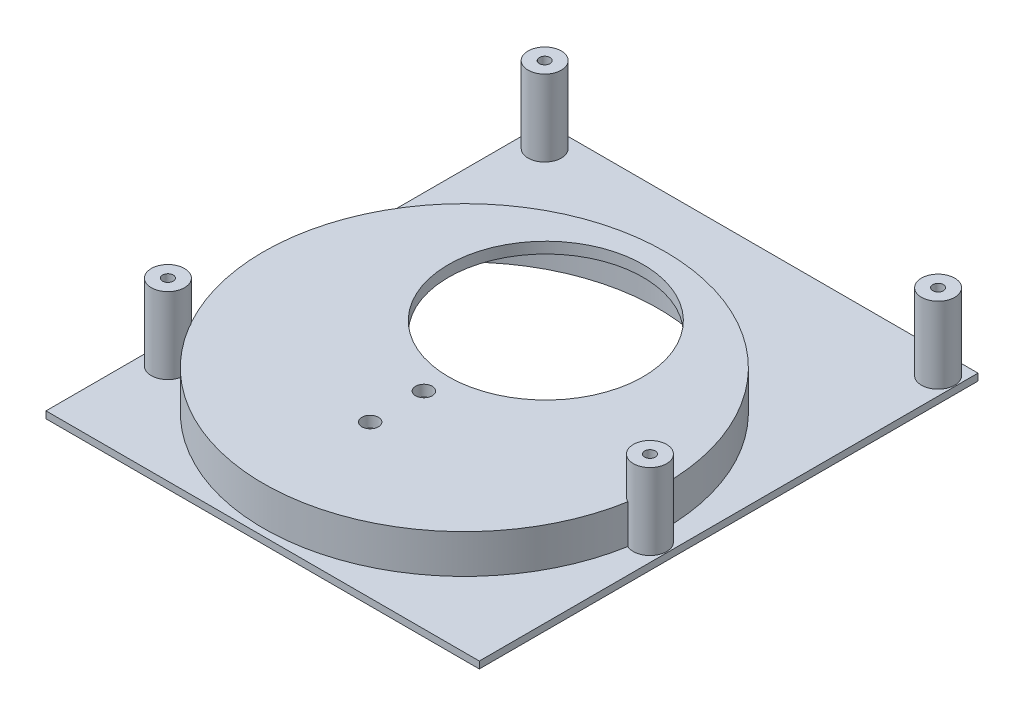
ISO-10303-21;
HEADER;
FILE_DESCRIPTION(('STEP AP214'),'2;1');
FILE_NAME('part.step','',(''),(''),'','','');
FILE_SCHEMA(('AUTOMOTIVE_DESIGN { 1 0 10303 214 1 1 1 1 }'));
ENDSEC;
DATA;
#1=APPLICATION_CONTEXT('core data for automotive mechanical design processes');
#2=APPLICATION_PROTOCOL_DEFINITION('international standard','automotive_design',2000,#1);
#3=PRODUCT_CONTEXT('',#1,'mechanical');
#4=PRODUCT('Part','Part','',(#3));
#5=PRODUCT_RELATED_PRODUCT_CATEGORY('part','',(#4));
#6=PRODUCT_DEFINITION_FORMATION('','',#4);
#7=PRODUCT_DEFINITION_CONTEXT('part definition',#1,'design');
#8=PRODUCT_DEFINITION('design','',#6,#7);
#9=PRODUCT_DEFINITION_SHAPE('','',#8);
#10=(LENGTH_UNIT() NAMED_UNIT(*) SI_UNIT(.MILLI.,.METRE.));
#11=(NAMED_UNIT(*) PLANE_ANGLE_UNIT() SI_UNIT($,.RADIAN.));
#12=(NAMED_UNIT(*) SI_UNIT($,.STERADIAN.) SOLID_ANGLE_UNIT());
#13=UNCERTAINTY_MEASURE_WITH_UNIT(LENGTH_MEASURE(1.E-05),#10,'distance_accuracy_value','');
#14=(GEOMETRIC_REPRESENTATION_CONTEXT(3) GLOBAL_UNCERTAINTY_ASSIGNED_CONTEXT((#13)) GLOBAL_UNIT_ASSIGNED_CONTEXT((#10,
#11,#12)) REPRESENTATION_CONTEXT('',''));
#15=CARTESIAN_POINT('',(0.,0.,0.));
#16=DIRECTION('',(0.,0.,1.));
#17=DIRECTION('',(1.,0.,0.));
#18=AXIS2_PLACEMENT_3D('',#15,#16,#17);
#19=CARTESIAN_POINT('',(-33.1283043886596,0.,-27.0683428392961));
#20=DIRECTION('',(0.,1.,0.));
#21=DIRECTION('',(0.,0.,1.));
#22=AXIS2_PLACEMENT_3D('',#19,#20,#21);
#23=CYLINDRICAL_SURFACE('',#22,44.45);
#24=CARTESIAN_POINT('',(-33.1283043886596,0.,-27.0683428392961));
#25=DIRECTION('',(0.,1.,0.));
#26=DIRECTION('',(0.,0.,1.));
#27=AXIS2_PLACEMENT_3D('',#24,#25,#26);
#28=CIRCLE('',#27,44.45);
#29=CARTESIAN_POINT('',(-33.1283043886596,0.,17.3816571607039));
#30=VERTEX_POINT('',#29);
#31=EDGE_CURVE('E172',#30,#30,#28,.T.);
#32=ORIENTED_EDGE('',*,*,#31,.F.);
#33=EDGE_LOOP('',(#32));
#34=FACE_BOUND('',#33,.T.);
#35=DIRECTION('',(0.,-1.,0.));
#36=VECTOR('',#35,1.);
#37=CARTESIAN_POINT('',(11.2917148238964,4.7625,-25.4360459434592));
#38=LINE('',#37,#36);
#39=CARTESIAN_POINT('',(11.2917148238964,7.9375,-25.4360459434592));
#40=VERTEX_POINT('',#39);
#41=CARTESIAN_POINT('',(11.2917148238964,1.5875,-25.4360459434592));
#42=VERTEX_POINT('',#41);
#43=EDGE_CURVE('E362',#40,#42,#38,.T.);
#44=ORIENTED_EDGE('',*,*,#43,.F.);
#45=CARTESIAN_POINT('',(-33.1283043886596,7.9375,-27.0683428392961));
#46=DIRECTION('',(0.,1.,0.));
#47=DIRECTION('',(0.,0.,1.));
#48=AXIS2_PLACEMENT_3D('',#45,#46,#47);
#49=CIRCLE('',#48,44.45);
#50=CARTESIAN_POINT('',(10.8098863535356,7.9375,-20.3424306853593));
#51=VERTEX_POINT('',#50);
#52=EDGE_CURVE('E380',#40,#51,#49,.T.);
#53=ORIENTED_EDGE('',*,*,#52,.T.);
#54=DIRECTION('',(0.,-1.,0.));
#55=VECTOR('',#54,1.);
#56=CARTESIAN_POINT('',(10.8098863535356,4.7625,-20.3424306853593));
#57=LINE('',#56,#55);
#58=CARTESIAN_POINT('',(10.8098863535356,1.5875,-20.3424306853593));
#59=VERTEX_POINT('',#58);
#60=EDGE_CURVE('E51',#59,#51,#57,.F.);
#61=ORIENTED_EDGE('',*,*,#60,.F.);
#62=CARTESIAN_POINT('',(-33.1283043886596,1.5875,-27.0683428392961));
#63=DIRECTION('',(0.,1.,0.));
#64=DIRECTION('',(0.,0.,1.));
#65=AXIS2_PLACEMENT_3D('',#62,#63,#64);
#66=CIRCLE('',#65,44.45);
#67=EDGE_CURVE('E55',#42,#59,#66,.F.);
#68=ORIENTED_EDGE('',*,*,#67,.F.);
#69=EDGE_LOOP('',(#44,#53,#61,#68));
#70=FACE_BOUND('',#69,.T.);
#71=ADVANCED_FACE('F36',(#34,#70),#23,.F.);
#72=CARTESIAN_POINT('',(-33.1283043886596,143.231213755503,-27.0683428392961));
#73=DIRECTION('',(0.,-1.,0.));
#74=DIRECTION('',(0.,0.,-1.));
#75=AXIS2_PLACEMENT_3D('',#72,#73,#74);
#76=CYLINDRICAL_SURFACE('',#75,46.0375);
#77=DIRECTION('',(0.,-1.,0.));
#78=VECTOR('',#77,1.);
#79=CARTESIAN_POINT('',(12.2285377446258,6.0325,-19.1811203911694));
#80=LINE('',#79,#78);
#81=CARTESIAN_POINT('',(12.2285377446257,10.4775,-19.1811203911693));
#82=VERTEX_POINT('',#81);
#83=CARTESIAN_POINT('',(12.2285377446257,1.5875,-19.1811203911694));
#84=VERTEX_POINT('',#83);
#85=EDGE_CURVE('E130',#82,#84,#80,.T.);
#86=ORIENTED_EDGE('',*,*,#85,.F.);
#87=CARTESIAN_POINT('',(-33.1283043886596,10.4775,-27.0683428392961));
#88=DIRECTION('',(0.,1.,0.));
#89=DIRECTION('',(0.,0.,1.));
#90=AXIS2_PLACEMENT_3D('',#87,#88,#89);
#91=CIRCLE('',#90,46.0375);
#92=CARTESIAN_POINT('',(-72.7118942561608,10.4775,-3.56109248006755));
#93=VERTEX_POINT('',#92);
#94=EDGE_CURVE('E153',#93,#82,#91,.T.);
#95=ORIENTED_EDGE('',*,*,#94,.F.);
#96=DIRECTION('',(0.,-1.,0.));
#97=VECTOR('',#96,1.);
#98=CARTESIAN_POINT('',(-72.7118942561609,5.23874999999999,-3.56109248006767));
#99=LINE('',#98,#97);
#100=CARTESIAN_POINT('',(-72.7118942561609,1.5875,-3.56109248006768));
#101=VERTEX_POINT('',#100);
#102=EDGE_CURVE('E211',#93,#101,#99,.T.);
#103=ORIENTED_EDGE('',*,*,#102,.T.);
#104=CARTESIAN_POINT('',(-33.1283043886596,1.58749999999999,-27.0683428392961));
#105=DIRECTION('',(0.,-1.,0.));
#106=DIRECTION('',(0.,0.,-1.));
#107=AXIS2_PLACEMENT_3D('',#104,#105,#106);
#108=CIRCLE('',#107,46.0375);
#109=EDGE_CURVE('E155',#101,#84,#108,.F.);
#110=ORIENTED_EDGE('',*,*,#109,.T.);
#111=EDGE_LOOP('',(#86,#95,#103,#110));
#112=FACE_BOUND('',#111,.T.);
#113=ADVANCED_FACE('F236',(#112),#76,.T.);
#114=DIRECTION('',(0.,-1.,0.));
#115=VECTOR('',#114,1.);
#116=CARTESIAN_POINT('',(12.9029616228515,6.0325,-26.3107442466989));
#117=LINE('',#116,#115);
#118=CARTESIAN_POINT('',(12.9029616228515,1.5875,-26.3107442466989));
#119=VERTEX_POINT('',#118);
#120=CARTESIAN_POINT('',(12.9029616228515,10.4775,-26.310744246699));
#121=VERTEX_POINT('',#120);
#122=EDGE_CURVE('E127',#119,#121,#117,.F.);
#123=ORIENTED_EDGE('',*,*,#122,.F.);
#124=CARTESIAN_POINT('',(-73.4066339678629,1.5875,-4.77243351585576));
#125=VERTEX_POINT('',#124);
#126=EDGE_CURVE('E142',#119,#125,#108,.F.);
#127=ORIENTED_EDGE('',*,*,#126,.T.);
#128=DIRECTION('',(0.,-1.,0.));
#129=VECTOR('',#128,1.);
#130=CARTESIAN_POINT('',(-73.4066339678629,5.23874999999999,-4.77243351585575));
#131=LINE('',#130,#129);
#132=CARTESIAN_POINT('',(-73.406633967863,10.4775,-4.77243351585587));
#133=VERTEX_POINT('',#132);
#134=EDGE_CURVE('E209',#125,#133,#131,.F.);
#135=ORIENTED_EDGE('',*,*,#134,.T.);
#136=EDGE_CURVE('E144',#121,#133,#91,.T.);
#137=ORIENTED_EDGE('',*,*,#136,.F.);
#138=EDGE_LOOP('',(#123,#127,#135,#137));
#139=FACE_BOUND('',#138,.T.);
#140=ADVANCED_FACE('F140',(#139),#76,.T.);
#141=CARTESIAN_POINT('',(0.,1.5875,0.));
#142=DIRECTION('',(0.,-1.,0.));
#143=DIRECTION('',(0.,0.,-1.));
#144=AXIS2_PLACEMENT_3D('',#141,#142,#143);
#145=PLANE('',#144);
#146=CARTESIAN_POINT('',(13.8616956113405,1.5875,-88.6633428392961));
#147=DIRECTION('',(0.,-1.,0.));
#148=DIRECTION('',(0.,0.,-1.));
#149=AXIS2_PLACEMENT_3D('',#146,#147,#148);
#150=CIRCLE('',#149,3.81);
#151=CARTESIAN_POINT('',(13.8616956113405,1.5875,-92.4733428392961));
#152=VERTEX_POINT('',#151);
#153=EDGE_CURVE('E12',#152,#152,#150,.F.);
#154=ORIENTED_EDGE('',*,*,#153,.F.);
#155=EDGE_LOOP('',(#154));
#156=FACE_BOUND('',#155,.T.);
#157=CARTESIAN_POINT('',(-76.3083043886595,1.5875,-88.6633428392961));
#158=DIRECTION('',(0.,-1.,0.));
#159=DIRECTION('',(0.,0.,-1.));
#160=AXIS2_PLACEMENT_3D('',#157,#158,#159);
#161=CIRCLE('',#160,3.81);
#162=CARTESIAN_POINT('',(-76.3083043886595,1.5875,-92.4733428392961));
#163=VERTEX_POINT('',#162);
#164=EDGE_CURVE('E44',#163,#163,#161,.F.);
#165=ORIENTED_EDGE('',*,*,#164,.F.);
#166=EDGE_LOOP('',(#165));
#167=FACE_BOUND('',#166,.T.);
#168=CARTESIAN_POINT('',(13.8616956113404,1.5875,-22.6233428392961));
#169=DIRECTION('',(0.,1.,0.));
#170=DIRECTION('',(0.,0.,1.));
#171=AXIS2_PLACEMENT_3D('',#168,#169,#170);
#172=CIRCLE('',#171,3.81);
#173=EDGE_CURVE('E124',#84,#119,#172,.T.);
#174=ORIENTED_EDGE('',*,*,#173,.F.);
#175=ORIENTED_EDGE('',*,*,#109,.F.);
#176=CARTESIAN_POINT('',(-76.3083043886596,1.5875,-2.30334283929615));
#177=DIRECTION('',(0.,-1.,0.));
#178=DIRECTION('',(0.,0.,-1.));
#179=AXIS2_PLACEMENT_3D('',#176,#177,#178);
#180=CIRCLE('',#179,3.81);
#181=EDGE_CURVE('E151',#125,#101,#180,.F.);
#182=ORIENTED_EDGE('',*,*,#181,.F.);
#183=ORIENTED_EDGE('',*,*,#126,.F.);
#184=EDGE_LOOP('',(#174,#175,#182,#183));
#185=FACE_BOUND('',#184,.T.);
#186=DIRECTION('',(-1.,0.,0.));
#187=VECTOR('',#186,1.);
#188=CARTESIAN_POINT('',(-81.3883043886595,1.5875,-93.7433428392961));
#189=LINE('',#188,#187);
#190=CARTESIAN_POINT('',(17.9256956113405,1.5875,-93.7433428392961));
#191=VERTEX_POINT('',#190);
#192=CARTESIAN_POINT('',(-81.3883043886595,1.5875,-93.7433428392961));
#193=VERTEX_POINT('',#192);
#194=EDGE_CURVE('E176',#191,#193,#189,.T.);
#195=ORIENTED_EDGE('',*,*,#194,.T.);
#196=DIRECTION('',(0.,0.,1.));
#197=VECTOR('',#196,1.);
#198=CARTESIAN_POINT('',(-81.3883043886595,1.5875,-93.7433428392961));
#199=LINE('',#198,#197);
#200=CARTESIAN_POINT('',(-81.3883043886595,1.5875,20.5566571607039));
#201=VERTEX_POINT('',#200);
#202=EDGE_CURVE('E179',#193,#201,#199,.T.);
#203=ORIENTED_EDGE('',*,*,#202,.T.);
#204=DIRECTION('',(1.,0.,0.));
#205=VECTOR('',#204,1.);
#206=CARTESIAN_POINT('',(-81.3883043886595,1.5875,20.5566571607039));
#207=LINE('',#206,#205);
#208=CARTESIAN_POINT('',(17.9256956113405,1.5875,20.5566571607039));
#209=VERTEX_POINT('',#208);
#210=EDGE_CURVE('E182',#201,#209,#207,.T.);
#211=ORIENTED_EDGE('',*,*,#210,.T.);
#212=DIRECTION('',(0.,0.,-1.));
#213=VECTOR('',#212,1.);
#214=CARTESIAN_POINT('',(17.9256956113405,1.5875,-93.7433428392961));
#215=LINE('',#214,#213);
#216=EDGE_CURVE('E184',#209,#191,#215,.T.);
#217=ORIENTED_EDGE('',*,*,#216,.T.);
#218=EDGE_LOOP('',(#195,#203,#211,#217));
#219=FACE_BOUND('',#218,.T.);
#220=ADVANCED_FACE('F148',(#156,#167,#185,#219),#145,.F.);
#221=CARTESIAN_POINT('',(-76.3083043886596,29.826307345283,-2.30334283929615));
#222=DIRECTION('',(0.,-1.,0.));
#223=DIRECTION('',(0.,0.,-1.));
#224=AXIS2_PLACEMENT_3D('',#221,#222,#223);
#225=CYLINDRICAL_SURFACE('',#224,3.81);
#226=CARTESIAN_POINT('',(-76.3083043886596,19.05,-2.30334283929615));
#227=DIRECTION('',(0.,1.,0.));
#228=DIRECTION('',(0.,0.,1.));
#229=AXIS2_PLACEMENT_3D('',#226,#227,#228);
#230=CIRCLE('',#229,3.81);
#231=CARTESIAN_POINT('',(-76.3083043886596,19.05,1.50665716070385));
#232=VERTEX_POINT('',#231);
#233=EDGE_CURVE('E169',#232,#232,#230,.T.);
#234=ORIENTED_EDGE('',*,*,#233,.F.);
#235=EDGE_LOOP('',(#234));
#236=FACE_BOUND('',#235,.T.);
#237=ORIENTED_EDGE('',*,*,#102,.F.);
#238=CARTESIAN_POINT('',(-76.3083043886596,10.4775,-2.30334283929615));
#239=DIRECTION('',(0.,1.,0.));
#240=DIRECTION('',(0.,0.,1.));
#241=AXIS2_PLACEMENT_3D('',#238,#239,#240);
#242=CIRCLE('',#241,3.81);
#243=EDGE_CURVE('E206',#93,#133,#242,.T.);
#244=ORIENTED_EDGE('',*,*,#243,.T.);
#245=ORIENTED_EDGE('',*,*,#134,.F.);
#246=ORIENTED_EDGE('',*,*,#181,.T.);
#247=EDGE_LOOP('',(#237,#244,#245,#246));
#248=FACE_BOUND('',#247,.T.);
#249=ADVANCED_FACE('F225',(#236,#248),#225,.T.);
#250=CARTESIAN_POINT('',(-81.3883043886595,1.5875,-93.7433428392961));
#251=DIRECTION('',(0.,0.,1.));
#252=DIRECTION('',(1.,0.,0.));
#253=AXIS2_PLACEMENT_3D('',#250,#251,#252);
#254=PLANE('',#253);
#255=DIRECTION('',(-1.,0.,0.));
#256=VECTOR('',#255,1.);
#257=CARTESIAN_POINT('',(-81.3883043886595,0.,-93.7433428392961));
#258=LINE('',#257,#256);
#259=CARTESIAN_POINT('',(17.9256956113405,0.,-93.7433428392961));
#260=VERTEX_POINT('',#259);
#261=CARTESIAN_POINT('',(-81.3883043886595,0.,-93.7433428392961));
#262=VERTEX_POINT('',#261);
#263=EDGE_CURVE('E175',#260,#262,#258,.T.);
#264=ORIENTED_EDGE('',*,*,#263,.T.);
#265=DIRECTION('',(0.,-1.,0.));
#266=VECTOR('',#265,1.);
#267=CARTESIAN_POINT('',(-81.3883043886595,1.5875,-93.7433428392961));
#268=LINE('',#267,#266);
#269=EDGE_CURVE('E202',#193,#262,#268,.T.);
#270=ORIENTED_EDGE('',*,*,#269,.F.);
#271=ORIENTED_EDGE('',*,*,#194,.F.);
#272=DIRECTION('',(0.,-1.,0.));
#273=VECTOR('',#272,1.);
#274=CARTESIAN_POINT('',(17.9256956113405,1.5875,-93.7433428392961));
#275=LINE('',#274,#273);
#276=EDGE_CURVE('E186',#191,#260,#275,.T.);
#277=ORIENTED_EDGE('',*,*,#276,.T.);
#278=EDGE_LOOP('',(#264,#270,#271,#277));
#279=FACE_BOUND('',#278,.T.);
#280=ADVANCED_FACE('F38',(#279),#254,.F.);
#281=CARTESIAN_POINT('',(-81.3883043886595,1.5875,-93.7433428392961));
#282=DIRECTION('',(1.,0.,0.));
#283=DIRECTION('',(0.,0.,-1.));
#284=AXIS2_PLACEMENT_3D('',#281,#282,#283);
#285=PLANE('',#284);
#286=DIRECTION('',(0.,0.,1.));
#287=VECTOR('',#286,1.);
#288=CARTESIAN_POINT('',(-81.3883043886595,0.,-93.7433428392961));
#289=LINE('',#288,#287);
#290=CARTESIAN_POINT('',(-81.3883043886595,0.,20.5566571607039));
#291=VERTEX_POINT('',#290);
#292=EDGE_CURVE('E189',#262,#291,#289,.T.);
#293=ORIENTED_EDGE('',*,*,#292,.T.);
#294=DIRECTION('',(0.,-1.,0.));
#295=VECTOR('',#294,1.);
#296=CARTESIAN_POINT('',(-81.3883043886595,1.5875,20.5566571607039));
#297=LINE('',#296,#295);
#298=EDGE_CURVE('E199',#201,#291,#297,.T.);
#299=ORIENTED_EDGE('',*,*,#298,.F.);
#300=ORIENTED_EDGE('',*,*,#202,.F.);
#301=ORIENTED_EDGE('',*,*,#269,.T.);
#302=EDGE_LOOP('',(#293,#299,#300,#301));
#303=FACE_BOUND('',#302,.T.);
#304=ADVANCED_FACE('F597',(#303),#285,.F.);
#305=CARTESIAN_POINT('',(-81.3883043886595,1.5875,20.5566571607039));
#306=DIRECTION('',(0.,0.,-1.));
#307=DIRECTION('',(-1.,0.,0.));
#308=AXIS2_PLACEMENT_3D('',#305,#306,#307);
#309=PLANE('',#308);
#310=DIRECTION('',(1.,0.,0.));
#311=VECTOR('',#310,1.);
#312=CARTESIAN_POINT('',(-81.3883043886595,0.,20.5566571607039));
#313=LINE('',#312,#311);
#314=CARTESIAN_POINT('',(17.9256956113405,0.,20.5566571607039));
#315=VERTEX_POINT('',#314);
#316=EDGE_CURVE('E191',#291,#315,#313,.T.);
#317=ORIENTED_EDGE('',*,*,#316,.T.);
#318=DIRECTION('',(0.,-1.,0.));
#319=VECTOR('',#318,1.);
#320=CARTESIAN_POINT('',(17.9256956113405,1.5875,20.5566571607039));
#321=LINE('',#320,#319);
#322=EDGE_CURVE('E196',#209,#315,#321,.T.);
#323=ORIENTED_EDGE('',*,*,#322,.F.);
#324=ORIENTED_EDGE('',*,*,#210,.F.);
#325=ORIENTED_EDGE('',*,*,#298,.T.);
#326=EDGE_LOOP('',(#317,#323,#324,#325));
#327=FACE_BOUND('',#326,.T.);
#328=ADVANCED_FACE('F589',(#327),#309,.F.);
#329=CARTESIAN_POINT('',(17.9256956113405,1.5875,-93.7433428392961));
#330=DIRECTION('',(-1.,0.,0.));
#331=DIRECTION('',(0.,0.,1.));
#332=AXIS2_PLACEMENT_3D('',#329,#330,#331);
#333=PLANE('',#332);
#334=DIRECTION('',(0.,0.,-1.));
#335=VECTOR('',#334,1.);
#336=CARTESIAN_POINT('',(17.9256956113405,0.,-93.7433428392961));
#337=LINE('',#336,#335);
#338=EDGE_CURVE('E180',#315,#260,#337,.T.);
#339=ORIENTED_EDGE('',*,*,#338,.T.);
#340=ORIENTED_EDGE('',*,*,#276,.F.);
#341=ORIENTED_EDGE('',*,*,#216,.F.);
#342=ORIENTED_EDGE('',*,*,#322,.T.);
#343=EDGE_LOOP('',(#339,#340,#341,#342));
#344=FACE_BOUND('',#343,.T.);
#345=ADVANCED_FACE('F520',(#344),#333,.F.);
#346=CARTESIAN_POINT('',(0.,0.,0.));
#347=DIRECTION('',(0.,-1.,0.));
#348=DIRECTION('',(0.,0.,-1.));
#349=AXIS2_PLACEMENT_3D('',#346,#347,#348);
#350=PLANE('',#349);
#351=ORIENTED_EDGE('',*,*,#31,.T.);
#352=EDGE_LOOP('',(#351));
#353=FACE_BOUND('',#352,.T.);
#354=ORIENTED_EDGE('',*,*,#263,.F.);
#355=ORIENTED_EDGE('',*,*,#338,.F.);
#356=ORIENTED_EDGE('',*,*,#316,.F.);
#357=ORIENTED_EDGE('',*,*,#292,.F.);
#358=EDGE_LOOP('',(#354,#355,#356,#357));
#359=FACE_BOUND('',#358,.T.);
#360=ADVANCED_FACE('F262',(#353,#359),#350,.T.);
#361=CARTESIAN_POINT('',(-76.3083043886596,29.826307345283,-2.30334283929615));
#362=DIRECTION('',(0.,-1.,0.));
#363=DIRECTION('',(0.,0.,-1.));
#364=AXIS2_PLACEMENT_3D('',#361,#362,#363);
#365=CYLINDRICAL_SURFACE('',#364,1.22396249999999);
#366=CARTESIAN_POINT('',(-76.3083043886596,1.5875,-2.30334283929615));
#367=DIRECTION('',(0.,1.,0.));
#368=DIRECTION('',(0.,0.,1.));
#369=AXIS2_PLACEMENT_3D('',#366,#367,#368);
#370=CIRCLE('',#369,1.22396249999999);
#371=CARTESIAN_POINT('',(-76.3083043886596,1.5875,-1.07938033929616));
#372=VERTEX_POINT('',#371);
#373=EDGE_CURVE('E164',#372,#372,#370,.T.);
#374=ORIENTED_EDGE('',*,*,#373,.F.);
#375=EDGE_LOOP('',(#374));
#376=FACE_BOUND('',#375,.T.);
#377=CARTESIAN_POINT('',(-76.3083043886596,19.05,-2.30334283929615));
#378=DIRECTION('',(0.,1.,0.));
#379=DIRECTION('',(0.,0.,1.));
#380=AXIS2_PLACEMENT_3D('',#377,#378,#379);
#381=CIRCLE('',#380,1.22396249999999);
#382=CARTESIAN_POINT('',(-76.3083043886596,19.05,-1.07938033929616));
#383=VERTEX_POINT('',#382);
#384=EDGE_CURVE('E161',#383,#383,#381,.T.);
#385=ORIENTED_EDGE('',*,*,#384,.T.);
#386=EDGE_LOOP('',(#385));
#387=FACE_BOUND('',#386,.T.);
#388=ADVANCED_FACE('F259',(#376,#387),#365,.F.);
#389=CARTESIAN_POINT('',(17.2221418257262,19.05,-42.6714368340742));
#390=DIRECTION('',(0.,1.,0.));
#391=DIRECTION('',(0.,0.,1.));
#392=AXIS2_PLACEMENT_3D('',#389,#390,#391);
#393=PLANE('',#392);
#394=ORIENTED_EDGE('',*,*,#384,.F.);
#395=EDGE_LOOP('',(#394));
#396=FACE_BOUND('',#395,.T.);
#397=ORIENTED_EDGE('',*,*,#233,.T.);
#398=EDGE_LOOP('',(#397));
#399=FACE_BOUND('',#398,.T.);
#400=ADVANCED_FACE('F249',(#396,#399),#393,.T.);
#401=ORIENTED_EDGE('',*,*,#373,.T.);
#402=EDGE_LOOP('',(#401));
#403=FACE_BOUND('',#402,.T.);
#404=ADVANCED_FACE('F229',(#403),#145,.F.);
#405=CARTESIAN_POINT('',(-33.1283043886596,10.4775,-27.0683428392961));
#406=DIRECTION('',(0.,1.,0.));
#407=DIRECTION('',(-1.,0.,0.));
#408=AXIS2_PLACEMENT_3D('',#405,#406,#407);
#409=PLANE('',#408);
#410=CARTESIAN_POINT('',(-33.1283043886596,10.4775,-45.7373428392961));
#411=DIRECTION('',(0.,1.,0.));
#412=DIRECTION('',(0.,0.,1.));
#413=AXIS2_PLACEMENT_3D('',#410,#411,#412);
#414=CIRCLE('',#413,22.2979473298766);
#415=CARTESIAN_POINT('',(-33.1283043886596,10.4775,-23.4393955094195));
#416=VERTEX_POINT('',#415);
#417=EDGE_CURVE('E329',#416,#416,#414,.T.);
#418=ORIENTED_EDGE('',*,*,#417,.F.);
#419=EDGE_LOOP('',(#418));
#420=FACE_BOUND('',#419,.T.);
#421=ORIENTED_EDGE('',*,*,#94,.T.);
#422=CARTESIAN_POINT('',(13.8616956113404,10.4775,-22.6233428392961));
#423=DIRECTION('',(0.,1.,0.));
#424=DIRECTION('',(0.,0.,1.));
#425=AXIS2_PLACEMENT_3D('',#422,#423,#424);
#426=CIRCLE('',#425,3.81);
#427=EDGE_CURVE('E145',#82,#121,#426,.F.);
#428=ORIENTED_EDGE('',*,*,#427,.T.);
#429=ORIENTED_EDGE('',*,*,#136,.T.);
#430=ORIENTED_EDGE('',*,*,#243,.F.);
#431=EDGE_LOOP('',(#421,#428,#429,#430));
#432=FACE_BOUND('',#431,.T.);
#433=CARTESIAN_POINT('',(-33.1283043886596,10.4775,-17.7973428392961));
#434=DIRECTION('',(0.,1.,0.));
#435=DIRECTION('',(0.,0.,1.));
#436=AXIS2_PLACEMENT_3D('',#433,#434,#435);
#437=CIRCLE('',#436,1.90500000000001);
#438=CARTESIAN_POINT('',(-33.1283043886596,10.4775,-15.8923428392961));
#439=VERTEX_POINT('',#438);
#440=EDGE_CURVE('E373',#439,#439,#437,.T.);
#441=ORIENTED_EDGE('',*,*,#440,.F.);
#442=EDGE_LOOP('',(#441));
#443=FACE_BOUND('',#442,.T.);
#444=CARTESIAN_POINT('',(-33.1283043886596,10.4775,-5.47834283929607));
#445=DIRECTION('',(0.,1.,0.));
#446=DIRECTION('',(0.,0.,1.));
#447=AXIS2_PLACEMENT_3D('',#444,#445,#446);
#448=CIRCLE('',#447,1.90500000000001);
#449=CARTESIAN_POINT('',(-33.1283043886596,10.4775,-3.57334283929606));
#450=VERTEX_POINT('',#449);
#451=EDGE_CURVE('E372',#450,#450,#448,.T.);
#452=ORIENTED_EDGE('',*,*,#451,.F.);
#453=EDGE_LOOP('',(#452));
#454=FACE_BOUND('',#453,.T.);
#455=ADVANCED_FACE('F248',(#420,#432,#443,#454),#409,.T.);
#456=CARTESIAN_POINT('',(-33.1283043886596,7.9375,-27.0683428392961));
#457=DIRECTION('',(0.,1.,0.));
#458=DIRECTION('',(0.,0.,1.));
#459=AXIS2_PLACEMENT_3D('',#456,#457,#458);
#460=PLANE('',#459);
#461=CARTESIAN_POINT('',(-33.1283043886596,7.9375,-45.7373428392961));
#462=DIRECTION('',(0.,1.,0.));
#463=DIRECTION('',(0.,0.,1.));
#464=AXIS2_PLACEMENT_3D('',#461,#462,#463);
#465=CIRCLE('',#464,22.2979473298766);
#466=CARTESIAN_POINT('',(-33.1283043886596,7.9375,-23.4393955094195));
#467=VERTEX_POINT('',#466);
#468=EDGE_CURVE('E332',#467,#467,#465,.F.);
#469=ORIENTED_EDGE('',*,*,#468,.F.);
#470=EDGE_LOOP('',(#469));
#471=FACE_BOUND('',#470,.T.);
#472=CARTESIAN_POINT('',(13.8616956113404,7.9375,-22.6233428392961));
#473=DIRECTION('',(0.,1.,0.));
#474=DIRECTION('',(0.,0.,1.));
#475=AXIS2_PLACEMENT_3D('',#472,#473,#474);
#476=CIRCLE('',#475,3.81);
#477=EDGE_CURVE('E213',#51,#40,#476,.F.);
#478=ORIENTED_EDGE('',*,*,#477,.F.);
#479=ORIENTED_EDGE('',*,*,#52,.F.);
#480=EDGE_LOOP('',(#478,#479));
#481=FACE_BOUND('',#480,.T.);
#482=CARTESIAN_POINT('',(-33.1283043886596,7.9375,-17.7973428392961));
#483=DIRECTION('',(0.,1.,0.));
#484=DIRECTION('',(0.,0.,1.));
#485=AXIS2_PLACEMENT_3D('',#482,#483,#484);
#486=CIRCLE('',#485,1.90500000000001);
#487=CARTESIAN_POINT('',(-33.1283043886596,7.9375,-15.8923428392961));
#488=VERTEX_POINT('',#487);
#489=EDGE_CURVE('E376',#488,#488,#486,.F.);
#490=ORIENTED_EDGE('',*,*,#489,.F.);
#491=EDGE_LOOP('',(#490));
#492=FACE_BOUND('',#491,.T.);
#493=CARTESIAN_POINT('',(-33.1283043886596,7.9375,-5.47834283929607));
#494=DIRECTION('',(0.,1.,0.));
#495=DIRECTION('',(0.,0.,1.));
#496=AXIS2_PLACEMENT_3D('',#493,#494,#495);
#497=CIRCLE('',#496,1.90500000000001);
#498=CARTESIAN_POINT('',(-33.1283043886596,7.9375,-3.57334283929606));
#499=VERTEX_POINT('',#498);
#500=EDGE_CURVE('E377',#499,#499,#497,.F.);
#501=ORIENTED_EDGE('',*,*,#500,.F.);
#502=EDGE_LOOP('',(#501));
#503=FACE_BOUND('',#502,.T.);
#504=ADVANCED_FACE('F268',(#471,#481,#492,#503),#460,.F.);
#505=CARTESIAN_POINT('',(-33.1283043886596,-0.000999999999999265,-5.47834283929607));
#506=DIRECTION('',(0.,1.,0.));
#507=DIRECTION('',(0.,0.,1.));
#508=AXIS2_PLACEMENT_3D('',#505,#506,#507);
#509=CYLINDRICAL_SURFACE('',#508,1.90500000000001);
#510=ORIENTED_EDGE('',*,*,#451,.T.);
#511=EDGE_LOOP('',(#510));
#512=FACE_BOUND('',#511,.T.);
#513=ORIENTED_EDGE('',*,*,#500,.T.);
#514=EDGE_LOOP('',(#513));
#515=FACE_BOUND('',#514,.T.);
#516=ADVANCED_FACE('F276',(#512,#515),#509,.F.);
#517=CARTESIAN_POINT('',(-33.1283043886596,-0.000999999999999265,-17.7973428392961));
#518=DIRECTION('',(0.,1.,0.));
#519=DIRECTION('',(0.,0.,1.));
#520=AXIS2_PLACEMENT_3D('',#517,#518,#519);
#521=CYLINDRICAL_SURFACE('',#520,1.90500000000001);
#522=ORIENTED_EDGE('',*,*,#440,.T.);
#523=EDGE_LOOP('',(#522));
#524=FACE_BOUND('',#523,.T.);
#525=ORIENTED_EDGE('',*,*,#489,.T.);
#526=EDGE_LOOP('',(#525));
#527=FACE_BOUND('',#526,.T.);
#528=ADVANCED_FACE('F280',(#524,#527),#521,.F.);
#529=CARTESIAN_POINT('',(13.8616956113404,29.826307345283,-22.6233428392961));
#530=DIRECTION('',(0.,-1.,0.));
#531=DIRECTION('',(0.,0.,-1.));
#532=AXIS2_PLACEMENT_3D('',#529,#530,#531);
#533=CYLINDRICAL_SURFACE('',#532,3.81);
#534=ORIENTED_EDGE('',*,*,#477,.T.);
#535=ORIENTED_EDGE('',*,*,#43,.T.);
#536=EDGE_CURVE('E135',#42,#59,#172,.T.);
#537=ORIENTED_EDGE('',*,*,#536,.T.);
#538=ORIENTED_EDGE('',*,*,#60,.T.);
#539=EDGE_LOOP('',(#534,#535,#537,#538));
#540=FACE_BOUND('',#539,.T.);
#541=ADVANCED_FACE('F284',(#540),#533,.T.);
#542=CARTESIAN_POINT('',(13.8616956113404,1.5875,-22.6233428392961));
#543=DIRECTION('',(0.,1.,0.));
#544=DIRECTION('',(0.,0.,1.));
#545=AXIS2_PLACEMENT_3D('',#542,#543,#544);
#546=PLANE('',#545);
#547=ORIENTED_EDGE('',*,*,#536,.F.);
#548=ORIENTED_EDGE('',*,*,#67,.T.);
#549=EDGE_LOOP('',(#547,#548));
#550=FACE_BOUND('',#549,.T.);
#551=ADVANCED_FACE('F291',(#550),#546,.F.);
#552=CARTESIAN_POINT('',(13.8616956113404,29.826307345283,-22.6233428392961));
#553=DIRECTION('',(0.,-1.,0.));
#554=DIRECTION('',(0.,0.,-1.));
#555=AXIS2_PLACEMENT_3D('',#552,#553,#554);
#556=CYLINDRICAL_SURFACE('',#555,1.2239625);
#557=CARTESIAN_POINT('',(13.8616956113404,19.05,-22.6233428392961));
#558=DIRECTION('',(0.,1.,0.));
#559=DIRECTION('',(0.,0.,1.));
#560=AXIS2_PLACEMENT_3D('',#557,#558,#559);
#561=CIRCLE('',#560,1.2239625);
#562=CARTESIAN_POINT('',(13.8616956113404,19.05,-21.3993803392961));
#563=VERTEX_POINT('',#562);
#564=EDGE_CURVE('E349',#563,#563,#561,.T.);
#565=ORIENTED_EDGE('',*,*,#564,.T.);
#566=EDGE_LOOP('',(#565));
#567=FACE_BOUND('',#566,.T.);
#568=DIRECTION('',(0.,-1.,0.));
#569=VECTOR('',#568,1.);
#570=CARTESIAN_POINT('',(12.6673546212384,6.0325,-22.3556979238422));
#571=LINE('',#570,#569);
#572=CARTESIAN_POINT('',(12.6673546212384,10.4775,-22.3556979238422));
#573=VERTEX_POINT('',#572);
#574=CARTESIAN_POINT('',(12.6673546212384,1.58749999999999,-22.3556979238422));
#575=VERTEX_POINT('',#574);
#576=EDGE_CURVE('E369',#573,#575,#571,.T.);
#577=ORIENTED_EDGE('',*,*,#576,.F.);
#578=CARTESIAN_POINT('',(13.8616956113404,10.4775,-22.6233428392961));
#579=DIRECTION('',(0.,1.,0.));
#580=DIRECTION('',(0.,0.,1.));
#581=AXIS2_PLACEMENT_3D('',#578,#579,#580);
#582=CIRCLE('',#581,1.2239625);
#583=CARTESIAN_POINT('',(12.7387257614086,10.4775,-23.1101928342128));
#584=VERTEX_POINT('',#583);
#585=EDGE_CURVE('E216',#573,#584,#582,.F.);
#586=ORIENTED_EDGE('',*,*,#585,.T.);
#587=DIRECTION('',(0.,-1.,0.));
#588=VECTOR('',#587,1.);
#589=CARTESIAN_POINT('',(12.7387257614086,6.0325,-23.1101928342127));
#590=LINE('',#589,#588);
#591=CARTESIAN_POINT('',(12.7387257614086,1.58749999999999,-23.1101928342128));
#592=VERTEX_POINT('',#591);
#593=EDGE_CURVE('E366',#592,#584,#590,.F.);
#594=ORIENTED_EDGE('',*,*,#593,.F.);
#595=CARTESIAN_POINT('',(13.8616956113404,1.5875,-22.6233428392961));
#596=DIRECTION('',(0.,1.,0.));
#597=DIRECTION('',(0.,0.,1.));
#598=AXIS2_PLACEMENT_3D('',#595,#596,#597);
#599=CIRCLE('',#598,1.2239625);
#600=EDGE_CURVE('E136',#575,#592,#599,.T.);
#601=ORIENTED_EDGE('',*,*,#600,.F.);
#602=EDGE_LOOP('',(#577,#586,#594,#601));
#603=FACE_BOUND('',#602,.T.);
#604=ADVANCED_FACE('F289',(#567,#603),#556,.F.);
#605=CARTESIAN_POINT('',(13.8616956113404,19.05,-22.6233428392961));
#606=DIRECTION('',(0.,1.,0.));
#607=DIRECTION('',(0.,0.,1.));
#608=AXIS2_PLACEMENT_3D('',#605,#606,#607);
#609=CIRCLE('',#608,3.81);
#610=CARTESIAN_POINT('',(13.8616956113404,19.05,-18.8133428392961));
#611=VERTEX_POINT('',#610);
#612=EDGE_CURVE('E355',#611,#611,#609,.T.);
#613=ORIENTED_EDGE('',*,*,#612,.F.);
#614=EDGE_LOOP('',(#613));
#615=FACE_BOUND('',#614,.T.);
#616=ORIENTED_EDGE('',*,*,#427,.F.);
#617=ORIENTED_EDGE('',*,*,#85,.T.);
#618=ORIENTED_EDGE('',*,*,#173,.T.);
#619=ORIENTED_EDGE('',*,*,#122,.T.);
#620=EDGE_LOOP('',(#616,#617,#618,#619));
#621=FACE_BOUND('',#620,.T.);
#622=ADVANCED_FACE('F126',(#615,#621),#533,.T.);
#623=CARTESIAN_POINT('',(17.2221418257262,19.05,-42.6714368340742));
#624=DIRECTION('',(0.,1.,0.));
#625=DIRECTION('',(0.,0.,1.));
#626=AXIS2_PLACEMENT_3D('',#623,#624,#625);
#627=PLANE('',#626);
#628=ORIENTED_EDGE('',*,*,#564,.F.);
#629=EDGE_LOOP('',(#628));
#630=FACE_BOUND('',#629,.T.);
#631=ORIENTED_EDGE('',*,*,#612,.T.);
#632=EDGE_LOOP('',(#631));
#633=FACE_BOUND('',#632,.T.);
#634=ADVANCED_FACE('F288',(#630,#633),#627,.T.);
#635=ORIENTED_EDGE('',*,*,#585,.F.);
#636=EDGE_CURVE('E158',#573,#584,#91,.T.);
#637=ORIENTED_EDGE('',*,*,#636,.T.);
#638=EDGE_LOOP('',(#635,#637));
#639=FACE_BOUND('',#638,.T.);
#640=ADVANCED_FACE('F270',(#639),#409,.T.);
#641=ORIENTED_EDGE('',*,*,#636,.F.);
#642=ORIENTED_EDGE('',*,*,#576,.T.);
#643=EDGE_CURVE('E152',#575,#592,#108,.F.);
#644=ORIENTED_EDGE('',*,*,#643,.T.);
#645=ORIENTED_EDGE('',*,*,#593,.T.);
#646=EDGE_LOOP('',(#641,#642,#644,#645));
#647=FACE_BOUND('',#646,.T.);
#648=ADVANCED_FACE('F238',(#647),#76,.T.);
#649=ORIENTED_EDGE('',*,*,#643,.F.);
#650=ORIENTED_EDGE('',*,*,#600,.T.);
#651=EDGE_LOOP('',(#649,#650));
#652=FACE_BOUND('',#651,.T.);
#653=ADVANCED_FACE('F251',(#652),#145,.F.);
#654=CARTESIAN_POINT('',(-76.3083043886595,29.826307345283,-88.6633428392961));
#655=DIRECTION('',(0.,-1.,0.));
#656=DIRECTION('',(0.,0.,-1.));
#657=AXIS2_PLACEMENT_3D('',#654,#655,#656);
#658=CYLINDRICAL_SURFACE('',#657,3.81);
#659=ORIENTED_EDGE('',*,*,#164,.T.);
#660=EDGE_LOOP('',(#659));
#661=FACE_BOUND('',#660,.T.);
#662=CARTESIAN_POINT('',(-76.3083043886595,19.05,-88.6633428392961));
#663=DIRECTION('',(0.,1.,0.));
#664=DIRECTION('',(0.,0.,1.));
#665=AXIS2_PLACEMENT_3D('',#662,#663,#664);
#666=CIRCLE('',#665,3.81);
#667=CARTESIAN_POINT('',(-76.3083043886595,19.05,-84.8533428392961));
#668=VERTEX_POINT('',#667);
#669=EDGE_CURVE('E346',#668,#668,#666,.T.);
#670=ORIENTED_EDGE('',*,*,#669,.F.);
#671=EDGE_LOOP('',(#670));
#672=FACE_BOUND('',#671,.T.);
#673=ADVANCED_FACE('F221',(#661,#672),#658,.T.);
#674=CARTESIAN_POINT('',(-76.3083043886595,29.826307345283,-88.6633428392961));
#675=DIRECTION('',(0.,-1.,0.));
#676=DIRECTION('',(0.,0.,-1.));
#677=AXIS2_PLACEMENT_3D('',#674,#675,#676);
#678=CYLINDRICAL_SURFACE('',#677,1.22396249999999);
#679=CARTESIAN_POINT('',(-76.3083043886595,1.5875,-88.6633428392961));
#680=DIRECTION('',(0.,1.,0.));
#681=DIRECTION('',(0.,0.,1.));
#682=AXIS2_PLACEMENT_3D('',#679,#680,#681);
#683=CIRCLE('',#682,1.22396249999999);
#684=CARTESIAN_POINT('',(-76.3083043886595,1.5875,-87.4393803392962));
#685=VERTEX_POINT('',#684);
#686=EDGE_CURVE('E350',#685,#685,#683,.T.);
#687=ORIENTED_EDGE('',*,*,#686,.F.);
#688=EDGE_LOOP('',(#687));
#689=FACE_BOUND('',#688,.T.);
#690=CARTESIAN_POINT('',(-76.3083043886595,19.05,-88.6633428392961));
#691=DIRECTION('',(0.,1.,0.));
#692=DIRECTION('',(0.,0.,1.));
#693=AXIS2_PLACEMENT_3D('',#690,#691,#692);
#694=CIRCLE('',#693,1.22396249999999);
#695=CARTESIAN_POINT('',(-76.3083043886595,19.05,-87.4393803392962));
#696=VERTEX_POINT('',#695);
#697=EDGE_CURVE('E343',#696,#696,#694,.T.);
#698=ORIENTED_EDGE('',*,*,#697,.T.);
#699=EDGE_LOOP('',(#698));
#700=FACE_BOUND('',#699,.T.);
#701=ADVANCED_FACE('F303',(#689,#700),#678,.F.);
#702=CARTESIAN_POINT('',(17.2221418257262,19.05,-42.6714368340742));
#703=DIRECTION('',(0.,1.,0.));
#704=DIRECTION('',(0.,0.,1.));
#705=AXIS2_PLACEMENT_3D('',#702,#703,#704);
#706=PLANE('',#705);
#707=ORIENTED_EDGE('',*,*,#697,.F.);
#708=EDGE_LOOP('',(#707));
#709=FACE_BOUND('',#708,.T.);
#710=ORIENTED_EDGE('',*,*,#669,.T.);
#711=EDGE_LOOP('',(#710));
#712=FACE_BOUND('',#711,.T.);
#713=ADVANCED_FACE('F306',(#709,#712),#706,.T.);
#714=ORIENTED_EDGE('',*,*,#686,.T.);
#715=EDGE_LOOP('',(#714));
#716=FACE_BOUND('',#715,.T.);
#717=ADVANCED_FACE('F246',(#716),#145,.F.);
#718=CARTESIAN_POINT('',(13.8616956113405,29.826307345283,-88.6633428392961));
#719=DIRECTION('',(0.,-1.,0.));
#720=DIRECTION('',(0.,0.,-1.));
#721=AXIS2_PLACEMENT_3D('',#718,#719,#720);
#722=CYLINDRICAL_SURFACE('',#721,3.81);
#723=ORIENTED_EDGE('',*,*,#153,.T.);
#724=EDGE_LOOP('',(#723));
#725=FACE_BOUND('',#724,.T.);
#726=CARTESIAN_POINT('',(13.8616956113405,19.05,-88.6633428392961));
#727=DIRECTION('',(0.,1.,0.));
#728=DIRECTION('',(0.,0.,1.));
#729=AXIS2_PLACEMENT_3D('',#726,#727,#728);
#730=CIRCLE('',#729,3.81);
#731=CARTESIAN_POINT('',(13.8616956113405,19.05,-84.8533428392961));
#732=VERTEX_POINT('',#731);
#733=EDGE_CURVE('E340',#732,#732,#730,.T.);
#734=ORIENTED_EDGE('',*,*,#733,.F.);
#735=EDGE_LOOP('',(#734));
#736=FACE_BOUND('',#735,.T.);
#737=ADVANCED_FACE('F311',(#725,#736),#722,.T.);
#738=CARTESIAN_POINT('',(13.8616956113405,29.826307345283,-88.6633428392961));
#739=DIRECTION('',(0.,-1.,0.));
#740=DIRECTION('',(0.,0.,-1.));
#741=AXIS2_PLACEMENT_3D('',#738,#739,#740);
#742=CYLINDRICAL_SURFACE('',#741,1.2239625);
#743=CARTESIAN_POINT('',(13.8616956113405,1.5875,-88.6633428392961));
#744=DIRECTION('',(0.,1.,0.));
#745=DIRECTION('',(0.,0.,1.));
#746=AXIS2_PLACEMENT_3D('',#743,#744,#745);
#747=CIRCLE('',#746,1.2239625);
#748=CARTESIAN_POINT('',(13.8616956113405,1.5875,-87.4393803392962));
#749=VERTEX_POINT('',#748);
#750=EDGE_CURVE('E336',#749,#749,#747,.T.);
#751=ORIENTED_EDGE('',*,*,#750,.F.);
#752=EDGE_LOOP('',(#751));
#753=FACE_BOUND('',#752,.T.);
#754=CARTESIAN_POINT('',(13.8616956113405,19.05,-88.6633428392961));
#755=DIRECTION('',(0.,1.,0.));
#756=DIRECTION('',(0.,0.,1.));
#757=AXIS2_PLACEMENT_3D('',#754,#755,#756);
#758=CIRCLE('',#757,1.2239625);
#759=CARTESIAN_POINT('',(13.8616956113405,19.05,-87.4393803392962));
#760=VERTEX_POINT('',#759);
#761=EDGE_CURVE('E333',#760,#760,#758,.T.);
#762=ORIENTED_EDGE('',*,*,#761,.T.);
#763=EDGE_LOOP('',(#762));
#764=FACE_BOUND('',#763,.T.);
#765=ADVANCED_FACE('F314',(#753,#764),#742,.F.);
#766=CARTESIAN_POINT('',(17.2221418257262,19.05,-42.6714368340742));
#767=DIRECTION('',(0.,1.,0.));
#768=DIRECTION('',(0.,0.,1.));
#769=AXIS2_PLACEMENT_3D('',#766,#767,#768);
#770=PLANE('',#769);
#771=ORIENTED_EDGE('',*,*,#761,.F.);
#772=EDGE_LOOP('',(#771));
#773=FACE_BOUND('',#772,.T.);
#774=ORIENTED_EDGE('',*,*,#733,.T.);
#775=EDGE_LOOP('',(#774));
#776=FACE_BOUND('',#775,.T.);
#777=ADVANCED_FACE('F244',(#773,#776),#770,.T.);
#778=ORIENTED_EDGE('',*,*,#750,.T.);
#779=EDGE_LOOP('',(#778));
#780=FACE_BOUND('',#779,.T.);
#781=ADVANCED_FACE('F228',(#780),#145,.F.);
#782=CARTESIAN_POINT('',(-33.1283043886596,-0.000999999999999265,-45.7373428392961));
#783=DIRECTION('',(0.,1.,0.));
#784=DIRECTION('',(0.,0.,1.));
#785=AXIS2_PLACEMENT_3D('',#782,#783,#784);
#786=CYLINDRICAL_SURFACE('',#785,22.2979473298766);
#787=ORIENTED_EDGE('',*,*,#417,.T.);
#788=EDGE_LOOP('',(#787));
#789=FACE_BOUND('',#788,.T.);
#790=ORIENTED_EDGE('',*,*,#468,.T.);
#791=EDGE_LOOP('',(#790));
#792=FACE_BOUND('',#791,.T.);
#793=ADVANCED_FACE('F243',(#789,#792),#786,.F.);
#794=CLOSED_SHELL('',(#71,#113,#140,#220,#249,#280,#304,#328,#345,#360,#388,#400,#404,#455,#504,
#516,#528,#541,#551,#604,#622,#634,#640,#648,#653,#673,#701,#713,#717,#737,#765,#777,#781,#793));
#795=MANIFOLD_SOLID_BREP('B2',#794);
#796=ADVANCED_BREP_SHAPE_REPRESENTATION('',(#18,#795),#14);
#797=SHAPE_DEFINITION_REPRESENTATION(#9,#796);
ENDSEC;
END-ISO-10303-21;
